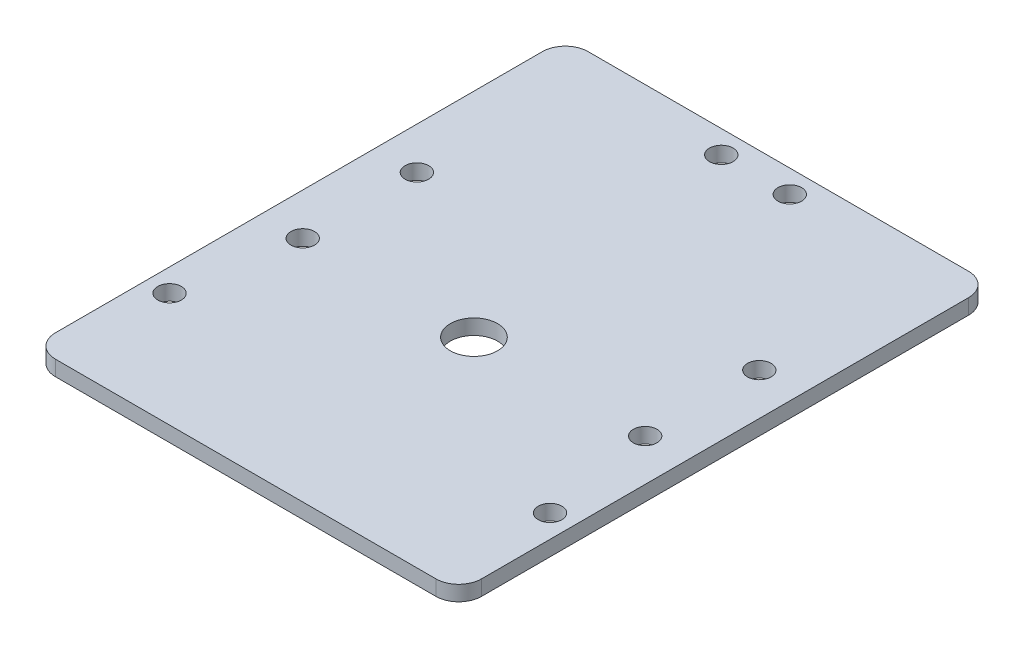
ISO-10303-21;
HEADER;
FILE_DESCRIPTION(('STEP AP214'),'2;1');
FILE_NAME('part.step','',(''),(''),'','','');
FILE_SCHEMA(('AUTOMOTIVE_DESIGN { 1 0 10303 214 1 1 1 1 }'));
ENDSEC;
DATA;
#1=APPLICATION_CONTEXT('core data for automotive mechanical design processes');
#2=APPLICATION_PROTOCOL_DEFINITION('international standard','automotive_design',2000,#1);
#3=PRODUCT_CONTEXT('',#1,'mechanical');
#4=PRODUCT('Part','Part','',(#3));
#5=PRODUCT_RELATED_PRODUCT_CATEGORY('part','',(#4));
#6=PRODUCT_DEFINITION_FORMATION('','',#4);
#7=PRODUCT_DEFINITION_CONTEXT('part definition',#1,'design');
#8=PRODUCT_DEFINITION('design','',#6,#7);
#9=PRODUCT_DEFINITION_SHAPE('','',#8);
#10=(LENGTH_UNIT() NAMED_UNIT(*) SI_UNIT(.MILLI.,.METRE.));
#11=(NAMED_UNIT(*) PLANE_ANGLE_UNIT() SI_UNIT($,.RADIAN.));
#12=(NAMED_UNIT(*) SI_UNIT($,.STERADIAN.) SOLID_ANGLE_UNIT());
#13=UNCERTAINTY_MEASURE_WITH_UNIT(LENGTH_MEASURE(1.E-05),#10,'distance_accuracy_value','');
#14=(GEOMETRIC_REPRESENTATION_CONTEXT(3) GLOBAL_UNCERTAINTY_ASSIGNED_CONTEXT((#13)) GLOBAL_UNIT_ASSIGNED_CONTEXT((#10,
#11,#12)) REPRESENTATION_CONTEXT('',''));
#15=CARTESIAN_POINT('',(0.,0.,0.));
#16=DIRECTION('',(0.,0.,1.));
#17=DIRECTION('',(1.,0.,0.));
#18=AXIS2_PLACEMENT_3D('',#15,#16,#17);
#19=CARTESIAN_POINT('',(28.,2.,0.));
#20=DIRECTION('',(1.,0.,0.));
#21=DIRECTION('',(0.,0.,-1.));
#22=AXIS2_PLACEMENT_3D('',#19,#20,#21);
#23=PLANE('',#22);
#24=DIRECTION('',(0.,0.,1.));
#25=VECTOR('',#24,1.);
#26=CARTESIAN_POINT('',(28.,2.,0.));
#27=LINE('',#26,#25);
#28=CARTESIAN_POINT('',(28.,2.,-32.));
#29=VERTEX_POINT('',#28);
#30=CARTESIAN_POINT('',(28.,2.,32.));
#31=VERTEX_POINT('',#30);
#32=EDGE_CURVE('E184',#29,#31,#27,.T.);
#33=ORIENTED_EDGE('',*,*,#32,.T.);
#34=DIRECTION('',(0.,-1.,0.));
#35=VECTOR('',#34,1.);
#36=CARTESIAN_POINT('',(28.,0.,32.));
#37=LINE('',#36,#35);
#38=CARTESIAN_POINT('',(28.,0.,32.));
#39=VERTEX_POINT('',#38);
#40=EDGE_CURVE('E128',#31,#39,#37,.T.);
#41=ORIENTED_EDGE('',*,*,#40,.T.);
#42=DIRECTION('',(0.,0.,1.));
#43=VECTOR('',#42,1.);
#44=CARTESIAN_POINT('',(28.,0.,0.));
#45=LINE('',#44,#43);
#46=CARTESIAN_POINT('',(28.,0.,-32.));
#47=VERTEX_POINT('',#46);
#48=EDGE_CURVE('E111',#47,#39,#45,.T.);
#49=ORIENTED_EDGE('',*,*,#48,.F.);
#50=DIRECTION('',(0.,-1.,0.));
#51=VECTOR('',#50,1.);
#52=CARTESIAN_POINT('',(28.,2.,-32.));
#53=LINE('',#52,#51);
#54=EDGE_CURVE('E125',#47,#29,#53,.F.);
#55=ORIENTED_EDGE('',*,*,#54,.T.);
#56=EDGE_LOOP('',(#33,#41,#49,#55));
#57=FACE_BOUND('',#56,.T.);
#58=ADVANCED_FACE('F41',(#57),#23,.T.);
#59=CARTESIAN_POINT('',(0.,2.,-35.));
#60=DIRECTION('',(0.,0.,-1.));
#61=DIRECTION('',(-1.,0.,0.));
#62=AXIS2_PLACEMENT_3D('',#59,#60,#61);
#63=PLANE('',#62);
#64=DIRECTION('',(1.,0.,0.));
#65=VECTOR('',#64,1.);
#66=CARTESIAN_POINT('',(0.,2.,-35.));
#67=LINE('',#66,#65);
#68=CARTESIAN_POINT('',(-25.,2.,-35.));
#69=VERTEX_POINT('',#68);
#70=CARTESIAN_POINT('',(25.,2.,-35.));
#71=VERTEX_POINT('',#70);
#72=EDGE_CURVE('E182',#69,#71,#67,.T.);
#73=ORIENTED_EDGE('',*,*,#72,.T.);
#74=DIRECTION('',(0.,-1.,0.));
#75=VECTOR('',#74,1.);
#76=CARTESIAN_POINT('',(25.,2.,-35.));
#77=LINE('',#76,#75);
#78=CARTESIAN_POINT('',(25.,0.,-35.));
#79=VERTEX_POINT('',#78);
#80=EDGE_CURVE('E175',#71,#79,#77,.T.);
#81=ORIENTED_EDGE('',*,*,#80,.T.);
#82=DIRECTION('',(1.,0.,0.));
#83=VECTOR('',#82,1.);
#84=CARTESIAN_POINT('',(0.,0.,-35.));
#85=LINE('',#84,#83);
#86=CARTESIAN_POINT('',(-25.,0.,-35.));
#87=VERTEX_POINT('',#86);
#88=EDGE_CURVE('E113',#87,#79,#85,.T.);
#89=ORIENTED_EDGE('',*,*,#88,.F.);
#90=DIRECTION('',(0.,-1.,0.));
#91=VECTOR('',#90,1.);
#92=CARTESIAN_POINT('',(-25.,2.,-35.));
#93=LINE('',#92,#91);
#94=EDGE_CURVE('E172',#87,#69,#93,.F.);
#95=ORIENTED_EDGE('',*,*,#94,.T.);
#96=EDGE_LOOP('',(#73,#81,#89,#95));
#97=FACE_BOUND('',#96,.T.);
#98=ADVANCED_FACE('F180',(#97),#63,.T.);
#99=CARTESIAN_POINT('',(-28.,2.,0.));
#100=DIRECTION('',(1.,0.,0.));
#101=DIRECTION('',(0.,0.,-1.));
#102=AXIS2_PLACEMENT_3D('',#99,#100,#101);
#103=PLANE('',#102);
#104=DIRECTION('',(0.,0.,1.));
#105=VECTOR('',#104,1.);
#106=CARTESIAN_POINT('',(-28.,2.,0.));
#107=LINE('',#106,#105);
#108=CARTESIAN_POINT('',(-28.,2.,-32.));
#109=VERTEX_POINT('',#108);
#110=CARTESIAN_POINT('',(-28.,2.,32.));
#111=VERTEX_POINT('',#110);
#112=EDGE_CURVE('E143',#109,#111,#107,.T.);
#113=ORIENTED_EDGE('',*,*,#112,.F.);
#114=DIRECTION('',(0.,-1.,0.));
#115=VECTOR('',#114,1.);
#116=CARTESIAN_POINT('',(-28.,0.,-32.));
#117=LINE('',#116,#115);
#118=CARTESIAN_POINT('',(-28.,0.,-32.));
#119=VERTEX_POINT('',#118);
#120=EDGE_CURVE('E11',#109,#119,#117,.T.);
#121=ORIENTED_EDGE('',*,*,#120,.T.);
#122=DIRECTION('',(0.,0.,1.));
#123=VECTOR('',#122,1.);
#124=CARTESIAN_POINT('',(-28.,0.,0.));
#125=LINE('',#124,#123);
#126=CARTESIAN_POINT('',(-28.,0.,32.));
#127=VERTEX_POINT('',#126);
#128=EDGE_CURVE('E229',#119,#127,#125,.T.);
#129=ORIENTED_EDGE('',*,*,#128,.T.);
#130=DIRECTION('',(0.,-1.,0.));
#131=VECTOR('',#130,1.);
#132=CARTESIAN_POINT('',(-28.,2.,32.));
#133=LINE('',#132,#131);
#134=EDGE_CURVE('E50',#127,#111,#133,.F.);
#135=ORIENTED_EDGE('',*,*,#134,.T.);
#136=EDGE_LOOP('',(#113,#121,#129,#135));
#137=FACE_BOUND('',#136,.T.);
#138=ADVANCED_FACE('F305',(#137),#103,.F.);
#139=CARTESIAN_POINT('',(-22.5,2.,5.));
#140=DIRECTION('',(0.,-1.,0.));
#141=DIRECTION('',(0.,0.,-1.));
#142=AXIS2_PLACEMENT_3D('',#139,#140,#141);
#143=CYLINDRICAL_SURFACE('',#142,1.55);
#144=CARTESIAN_POINT('',(-22.5,2.,5.));
#145=DIRECTION('',(0.,1.,0.));
#146=DIRECTION('',(0.,0.,1.));
#147=AXIS2_PLACEMENT_3D('',#144,#145,#146);
#148=CIRCLE('',#147,1.55);
#149=CARTESIAN_POINT('',(-22.5,2.,6.55));
#150=VERTEX_POINT('',#149);
#151=EDGE_CURVE('E189',#150,#150,#148,.T.);
#152=ORIENTED_EDGE('',*,*,#151,.T.);
#153=EDGE_LOOP('',(#152));
#154=FACE_BOUND('',#153,.T.);
#155=CARTESIAN_POINT('',(-22.5,0.,5.));
#156=DIRECTION('',(0.,1.,0.));
#157=DIRECTION('',(0.,0.,1.));
#158=AXIS2_PLACEMENT_3D('',#155,#156,#157);
#159=CIRCLE('',#158,1.55);
#160=CARTESIAN_POINT('',(-22.5,0.,6.55));
#161=VERTEX_POINT('',#160);
#162=EDGE_CURVE('E130',#161,#161,#159,.T.);
#163=ORIENTED_EDGE('',*,*,#162,.F.);
#164=EDGE_LOOP('',(#163));
#165=FACE_BOUND('',#164,.T.);
#166=ADVANCED_FACE('F275',(#154,#165),#143,.F.);
#167=CARTESIAN_POINT('',(22.5,2.,5.));
#168=DIRECTION('',(0.,-1.,0.));
#169=DIRECTION('',(0.,0.,-1.));
#170=AXIS2_PLACEMENT_3D('',#167,#168,#169);
#171=CYLINDRICAL_SURFACE('',#170,1.55);
#172=CARTESIAN_POINT('',(22.5,2.,5.));
#173=DIRECTION('',(0.,1.,0.));
#174=DIRECTION('',(0.,0.,1.));
#175=AXIS2_PLACEMENT_3D('',#172,#173,#174);
#176=CIRCLE('',#175,1.55);
#177=CARTESIAN_POINT('',(22.5,2.,6.55));
#178=VERTEX_POINT('',#177);
#179=EDGE_CURVE('E268',#178,#178,#176,.T.);
#180=ORIENTED_EDGE('',*,*,#179,.T.);
#181=EDGE_LOOP('',(#180));
#182=FACE_BOUND('',#181,.T.);
#183=CARTESIAN_POINT('',(22.5,0.,5.));
#184=DIRECTION('',(0.,1.,0.));
#185=DIRECTION('',(0.,0.,1.));
#186=AXIS2_PLACEMENT_3D('',#183,#184,#185);
#187=CIRCLE('',#186,1.55);
#188=CARTESIAN_POINT('',(22.5,0.,6.55));
#189=VERTEX_POINT('',#188);
#190=EDGE_CURVE('E221',#189,#189,#187,.T.);
#191=ORIENTED_EDGE('',*,*,#190,.F.);
#192=EDGE_LOOP('',(#191));
#193=FACE_BOUND('',#192,.T.);
#194=ADVANCED_FACE('F310',(#182,#193),#171,.F.);
#195=CARTESIAN_POINT('',(-4.5,2.,-32.));
#196=DIRECTION('',(0.,-1.,0.));
#197=DIRECTION('',(0.,0.,-1.));
#198=AXIS2_PLACEMENT_3D('',#195,#196,#197);
#199=CYLINDRICAL_SURFACE('',#198,1.55);
#200=CARTESIAN_POINT('',(-4.5,2.,-32.));
#201=DIRECTION('',(0.,1.,0.));
#202=DIRECTION('',(0.,0.,1.));
#203=AXIS2_PLACEMENT_3D('',#200,#201,#202);
#204=CIRCLE('',#203,1.55);
#205=CARTESIAN_POINT('',(-4.5,2.,-30.45));
#206=VERTEX_POINT('',#205);
#207=EDGE_CURVE('E264',#206,#206,#204,.T.);
#208=ORIENTED_EDGE('',*,*,#207,.T.);
#209=EDGE_LOOP('',(#208));
#210=FACE_BOUND('',#209,.T.);
#211=CARTESIAN_POINT('',(-4.5,0.,-32.));
#212=DIRECTION('',(0.,1.,0.));
#213=DIRECTION('',(0.,0.,1.));
#214=AXIS2_PLACEMENT_3D('',#211,#212,#213);
#215=CIRCLE('',#214,1.55);
#216=CARTESIAN_POINT('',(-4.5,0.,-30.45));
#217=VERTEX_POINT('',#216);
#218=EDGE_CURVE('E217',#217,#217,#215,.T.);
#219=ORIENTED_EDGE('',*,*,#218,.F.);
#220=EDGE_LOOP('',(#219));
#221=FACE_BOUND('',#220,.T.);
#222=ADVANCED_FACE('F313',(#210,#221),#199,.F.);
#223=CARTESIAN_POINT('',(-22.5,2.,-10.));
#224=DIRECTION('',(0.,-1.,0.));
#225=DIRECTION('',(0.,0.,-1.));
#226=AXIS2_PLACEMENT_3D('',#223,#224,#225);
#227=CYLINDRICAL_SURFACE('',#226,1.55);
#228=CARTESIAN_POINT('',(-22.5,2.,-10.));
#229=DIRECTION('',(0.,1.,0.));
#230=DIRECTION('',(0.,0.,1.));
#231=AXIS2_PLACEMENT_3D('',#228,#229,#230);
#232=CIRCLE('',#231,1.55);
#233=CARTESIAN_POINT('',(-22.5,2.,-8.45));
#234=VERTEX_POINT('',#233);
#235=EDGE_CURVE('E260',#234,#234,#232,.T.);
#236=ORIENTED_EDGE('',*,*,#235,.T.);
#237=EDGE_LOOP('',(#236));
#238=FACE_BOUND('',#237,.T.);
#239=CARTESIAN_POINT('',(-22.5,0.,-10.));
#240=DIRECTION('',(0.,1.,0.));
#241=DIRECTION('',(0.,0.,1.));
#242=AXIS2_PLACEMENT_3D('',#239,#240,#241);
#243=CIRCLE('',#242,1.55);
#244=CARTESIAN_POINT('',(-22.5,0.,-8.45));
#245=VERTEX_POINT('',#244);
#246=EDGE_CURVE('E213',#245,#245,#243,.T.);
#247=ORIENTED_EDGE('',*,*,#246,.F.);
#248=EDGE_LOOP('',(#247));
#249=FACE_BOUND('',#248,.T.);
#250=ADVANCED_FACE('F317',(#238,#249),#227,.F.);
#251=CARTESIAN_POINT('',(22.5,2.,-10.));
#252=DIRECTION('',(0.,-1.,0.));
#253=DIRECTION('',(0.,0.,-1.));
#254=AXIS2_PLACEMENT_3D('',#251,#252,#253);
#255=CYLINDRICAL_SURFACE('',#254,1.55);
#256=CARTESIAN_POINT('',(22.5,2.,-10.));
#257=DIRECTION('',(0.,1.,0.));
#258=DIRECTION('',(0.,0.,1.));
#259=AXIS2_PLACEMENT_3D('',#256,#257,#258);
#260=CIRCLE('',#259,1.55);
#261=CARTESIAN_POINT('',(22.5,2.,-8.45));
#262=VERTEX_POINT('',#261);
#263=EDGE_CURVE('E256',#262,#262,#260,.T.);
#264=ORIENTED_EDGE('',*,*,#263,.T.);
#265=EDGE_LOOP('',(#264));
#266=FACE_BOUND('',#265,.T.);
#267=CARTESIAN_POINT('',(22.5,0.,-10.));
#268=DIRECTION('',(0.,1.,0.));
#269=DIRECTION('',(0.,0.,1.));
#270=AXIS2_PLACEMENT_3D('',#267,#268,#269);
#271=CIRCLE('',#270,1.55);
#272=CARTESIAN_POINT('',(22.5,0.,-8.45));
#273=VERTEX_POINT('',#272);
#274=EDGE_CURVE('E209',#273,#273,#271,.T.);
#275=ORIENTED_EDGE('',*,*,#274,.F.);
#276=EDGE_LOOP('',(#275));
#277=FACE_BOUND('',#276,.T.);
#278=ADVANCED_FACE('F321',(#266,#277),#255,.F.);
#279=CARTESIAN_POINT('',(-25.,2.,20.));
#280=DIRECTION('',(0.,-1.,0.));
#281=DIRECTION('',(0.,0.,-1.));
#282=AXIS2_PLACEMENT_3D('',#279,#280,#281);
#283=CYLINDRICAL_SURFACE('',#282,1.55);
#284=CARTESIAN_POINT('',(-25.,2.,20.));
#285=DIRECTION('',(0.,1.,0.));
#286=DIRECTION('',(0.,0.,1.));
#287=AXIS2_PLACEMENT_3D('',#284,#285,#286);
#288=CIRCLE('',#287,1.55);
#289=CARTESIAN_POINT('',(-25.,2.,21.55));
#290=VERTEX_POINT('',#289);
#291=EDGE_CURVE('E252',#290,#290,#288,.T.);
#292=ORIENTED_EDGE('',*,*,#291,.T.);
#293=EDGE_LOOP('',(#292));
#294=FACE_BOUND('',#293,.T.);
#295=CARTESIAN_POINT('',(-25.,0.,20.));
#296=DIRECTION('',(0.,1.,0.));
#297=DIRECTION('',(0.,0.,1.));
#298=AXIS2_PLACEMENT_3D('',#295,#296,#297);
#299=CIRCLE('',#298,1.55);
#300=CARTESIAN_POINT('',(-25.,0.,21.55));
#301=VERTEX_POINT('',#300);
#302=EDGE_CURVE('E205',#301,#301,#299,.T.);
#303=ORIENTED_EDGE('',*,*,#302,.F.);
#304=EDGE_LOOP('',(#303));
#305=FACE_BOUND('',#304,.T.);
#306=ADVANCED_FACE('F325',(#294,#305),#283,.F.);
#307=CARTESIAN_POINT('',(25.,2.,20.));
#308=DIRECTION('',(0.,-1.,0.));
#309=DIRECTION('',(0.,0.,-1.));
#310=AXIS2_PLACEMENT_3D('',#307,#308,#309);
#311=CYLINDRICAL_SURFACE('',#310,1.55);
#312=CARTESIAN_POINT('',(25.,2.,20.));
#313=DIRECTION('',(0.,1.,0.));
#314=DIRECTION('',(0.,0.,1.));
#315=AXIS2_PLACEMENT_3D('',#312,#313,#314);
#316=CIRCLE('',#315,1.55);
#317=CARTESIAN_POINT('',(25.,2.,21.55));
#318=VERTEX_POINT('',#317);
#319=EDGE_CURVE('E246',#318,#318,#316,.T.);
#320=ORIENTED_EDGE('',*,*,#319,.T.);
#321=EDGE_LOOP('',(#320));
#322=FACE_BOUND('',#321,.T.);
#323=CARTESIAN_POINT('',(25.,0.,20.));
#324=DIRECTION('',(0.,1.,0.));
#325=DIRECTION('',(0.,0.,1.));
#326=AXIS2_PLACEMENT_3D('',#323,#324,#325);
#327=CIRCLE('',#326,1.55);
#328=CARTESIAN_POINT('',(25.,0.,21.55));
#329=VERTEX_POINT('',#328);
#330=EDGE_CURVE('E201',#329,#329,#327,.T.);
#331=ORIENTED_EDGE('',*,*,#330,.F.);
#332=EDGE_LOOP('',(#331));
#333=FACE_BOUND('',#332,.T.);
#334=ADVANCED_FACE('F329',(#322,#333),#311,.F.);
#335=CARTESIAN_POINT('',(0.,2.,5.));
#336=DIRECTION('',(0.,-1.,0.));
#337=DIRECTION('',(0.,0.,-1.));
#338=AXIS2_PLACEMENT_3D('',#335,#336,#337);
#339=CYLINDRICAL_SURFACE('',#338,3.1);
#340=CARTESIAN_POINT('',(0.,2.,5.));
#341=DIRECTION('',(0.,1.,0.));
#342=DIRECTION('',(0.,0.,1.));
#343=AXIS2_PLACEMENT_3D('',#340,#341,#342);
#344=CIRCLE('',#343,3.1);
#345=CARTESIAN_POINT('',(0.,2.,8.1));
#346=VERTEX_POINT('',#345);
#347=EDGE_CURVE('E240',#346,#346,#344,.T.);
#348=ORIENTED_EDGE('',*,*,#347,.T.);
#349=EDGE_LOOP('',(#348));
#350=FACE_BOUND('',#349,.T.);
#351=CARTESIAN_POINT('',(0.,0.,5.));
#352=DIRECTION('',(0.,1.,0.));
#353=DIRECTION('',(0.,0.,1.));
#354=AXIS2_PLACEMENT_3D('',#351,#352,#353);
#355=CIRCLE('',#354,3.1);
#356=CARTESIAN_POINT('',(0.,0.,8.1));
#357=VERTEX_POINT('',#356);
#358=EDGE_CURVE('E197',#357,#357,#355,.T.);
#359=ORIENTED_EDGE('',*,*,#358,.F.);
#360=EDGE_LOOP('',(#359));
#361=FACE_BOUND('',#360,.T.);
#362=ADVANCED_FACE('F296',(#350,#361),#339,.F.);
#363=CARTESIAN_POINT('',(4.5,2.,-32.));
#364=DIRECTION('',(0.,-1.,0.));
#365=DIRECTION('',(0.,0.,-1.));
#366=AXIS2_PLACEMENT_3D('',#363,#364,#365);
#367=CYLINDRICAL_SURFACE('',#366,1.55);
#368=CARTESIAN_POINT('',(4.5,2.,-32.));
#369=DIRECTION('',(0.,1.,0.));
#370=DIRECTION('',(0.,0.,1.));
#371=AXIS2_PLACEMENT_3D('',#368,#369,#370);
#372=CIRCLE('',#371,1.55);
#373=CARTESIAN_POINT('',(4.5,2.,-30.45));
#374=VERTEX_POINT('',#373);
#375=EDGE_CURVE('E234',#374,#374,#372,.T.);
#376=ORIENTED_EDGE('',*,*,#375,.T.);
#377=EDGE_LOOP('',(#376));
#378=FACE_BOUND('',#377,.T.);
#379=CARTESIAN_POINT('',(4.5,0.,-32.));
#380=DIRECTION('',(0.,1.,0.));
#381=DIRECTION('',(0.,0.,1.));
#382=AXIS2_PLACEMENT_3D('',#379,#380,#381);
#383=CIRCLE('',#382,1.55);
#384=CARTESIAN_POINT('',(4.5,0.,-30.45));
#385=VERTEX_POINT('',#384);
#386=EDGE_CURVE('E193',#385,#385,#383,.T.);
#387=ORIENTED_EDGE('',*,*,#386,.F.);
#388=EDGE_LOOP('',(#387));
#389=FACE_BOUND('',#388,.T.);
#390=ADVANCED_FACE('F291',(#378,#389),#367,.F.);
#391=CARTESIAN_POINT('',(0.,2.,35.));
#392=DIRECTION('',(0.,0.,-1.));
#393=DIRECTION('',(-1.,0.,0.));
#394=AXIS2_PLACEMENT_3D('',#391,#392,#393);
#395=PLANE('',#394);
#396=DIRECTION('',(1.,0.,0.));
#397=VECTOR('',#396,1.);
#398=CARTESIAN_POINT('',(0.,0.,35.));
#399=LINE('',#398,#397);
#400=CARTESIAN_POINT('',(-25.,0.,35.));
#401=VERTEX_POINT('',#400);
#402=CARTESIAN_POINT('',(25.,0.,35.));
#403=VERTEX_POINT('',#402);
#404=EDGE_CURVE('E146',#401,#403,#399,.T.);
#405=ORIENTED_EDGE('',*,*,#404,.T.);
#406=DIRECTION('',(0.,-1.,0.));
#407=VECTOR('',#406,1.);
#408=CARTESIAN_POINT('',(25.,2.,35.));
#409=LINE('',#408,#407);
#410=CARTESIAN_POINT('',(25.,2.,35.));
#411=VERTEX_POINT('',#410);
#412=EDGE_CURVE('E159',#403,#411,#409,.F.);
#413=ORIENTED_EDGE('',*,*,#412,.T.);
#414=DIRECTION('',(1.,0.,0.));
#415=VECTOR('',#414,1.);
#416=CARTESIAN_POINT('',(0.,2.,35.));
#417=LINE('',#416,#415);
#418=CARTESIAN_POINT('',(-25.,2.,35.));
#419=VERTEX_POINT('',#418);
#420=EDGE_CURVE('E136',#419,#411,#417,.T.);
#421=ORIENTED_EDGE('',*,*,#420,.F.);
#422=DIRECTION('',(0.,-1.,0.));
#423=VECTOR('',#422,1.);
#424=CARTESIAN_POINT('',(-25.,2.,35.));
#425=LINE('',#424,#423);
#426=EDGE_CURVE('E155',#419,#401,#425,.T.);
#427=ORIENTED_EDGE('',*,*,#426,.T.);
#428=EDGE_LOOP('',(#405,#413,#421,#427));
#429=FACE_BOUND('',#428,.T.);
#430=ADVANCED_FACE('F280',(#429),#395,.F.);
#431=CARTESIAN_POINT('',(0.,2.,0.));
#432=DIRECTION('',(0.,1.,0.));
#433=DIRECTION('',(0.,0.,1.));
#434=AXIS2_PLACEMENT_3D('',#431,#432,#433);
#435=PLANE('',#434);
#436=ORIENTED_EDGE('',*,*,#375,.F.);
#437=EDGE_LOOP('',(#436));
#438=FACE_BOUND('',#437,.T.);
#439=ORIENTED_EDGE('',*,*,#347,.F.);
#440=EDGE_LOOP('',(#439));
#441=FACE_BOUND('',#440,.T.);
#442=ORIENTED_EDGE('',*,*,#319,.F.);
#443=EDGE_LOOP('',(#442));
#444=FACE_BOUND('',#443,.T.);
#445=ORIENTED_EDGE('',*,*,#291,.F.);
#446=EDGE_LOOP('',(#445));
#447=FACE_BOUND('',#446,.T.);
#448=ORIENTED_EDGE('',*,*,#263,.F.);
#449=EDGE_LOOP('',(#448));
#450=FACE_BOUND('',#449,.T.);
#451=ORIENTED_EDGE('',*,*,#235,.F.);
#452=EDGE_LOOP('',(#451));
#453=FACE_BOUND('',#452,.T.);
#454=ORIENTED_EDGE('',*,*,#207,.F.);
#455=EDGE_LOOP('',(#454));
#456=FACE_BOUND('',#455,.T.);
#457=ORIENTED_EDGE('',*,*,#179,.F.);
#458=EDGE_LOOP('',(#457));
#459=FACE_BOUND('',#458,.T.);
#460=ORIENTED_EDGE('',*,*,#151,.F.);
#461=EDGE_LOOP('',(#460));
#462=FACE_BOUND('',#461,.T.);
#463=ORIENTED_EDGE('',*,*,#420,.T.);
#464=CARTESIAN_POINT('',(25.,2.,32.));
#465=DIRECTION('',(0.,1.,0.));
#466=DIRECTION('',(0.,0.,1.));
#467=AXIS2_PLACEMENT_3D('',#464,#465,#466);
#468=CIRCLE('',#467,3.);
#469=EDGE_CURVE('E169',#411,#31,#468,.T.);
#470=ORIENTED_EDGE('',*,*,#469,.T.);
#471=ORIENTED_EDGE('',*,*,#32,.F.);
#472=CARTESIAN_POINT('',(25.,2.,-32.));
#473=DIRECTION('',(0.,1.,0.));
#474=DIRECTION('',(0.,0.,1.));
#475=AXIS2_PLACEMENT_3D('',#472,#473,#474);
#476=CIRCLE('',#475,3.);
#477=EDGE_CURVE('E134',#29,#71,#476,.T.);
#478=ORIENTED_EDGE('',*,*,#477,.T.);
#479=ORIENTED_EDGE('',*,*,#72,.F.);
#480=CARTESIAN_POINT('',(-25.,2.,-32.));
#481=DIRECTION('',(0.,1.,0.));
#482=DIRECTION('',(0.,0.,1.));
#483=AXIS2_PLACEMENT_3D('',#480,#481,#482);
#484=CIRCLE('',#483,3.);
#485=EDGE_CURVE('E63',#69,#109,#484,.T.);
#486=ORIENTED_EDGE('',*,*,#485,.T.);
#487=ORIENTED_EDGE('',*,*,#112,.T.);
#488=CARTESIAN_POINT('',(-25.,2.,32.));
#489=DIRECTION('',(0.,1.,0.));
#490=DIRECTION('',(0.,0.,1.));
#491=AXIS2_PLACEMENT_3D('',#488,#489,#490);
#492=CIRCLE('',#491,3.);
#493=EDGE_CURVE('E162',#111,#419,#492,.T.);
#494=ORIENTED_EDGE('',*,*,#493,.T.);
#495=EDGE_LOOP('',(#463,#470,#471,#478,#479,#486,#487,#494));
#496=FACE_BOUND('',#495,.T.);
#497=ADVANCED_FACE('F278',(#438,#441,#444,#447,#450,#453,#456,#459,#462,#496),#435,.T.);
#498=CARTESIAN_POINT('',(0.,0.,0.));
#499=DIRECTION('',(0.,1.,0.));
#500=DIRECTION('',(0.,0.,1.));
#501=AXIS2_PLACEMENT_3D('',#498,#499,#500);
#502=PLANE('',#501);
#503=ORIENTED_EDGE('',*,*,#386,.T.);
#504=EDGE_LOOP('',(#503));
#505=FACE_BOUND('',#504,.T.);
#506=ORIENTED_EDGE('',*,*,#358,.T.);
#507=EDGE_LOOP('',(#506));
#508=FACE_BOUND('',#507,.T.);
#509=ORIENTED_EDGE('',*,*,#330,.T.);
#510=EDGE_LOOP('',(#509));
#511=FACE_BOUND('',#510,.T.);
#512=ORIENTED_EDGE('',*,*,#302,.T.);
#513=EDGE_LOOP('',(#512));
#514=FACE_BOUND('',#513,.T.);
#515=ORIENTED_EDGE('',*,*,#274,.T.);
#516=EDGE_LOOP('',(#515));
#517=FACE_BOUND('',#516,.T.);
#518=ORIENTED_EDGE('',*,*,#246,.T.);
#519=EDGE_LOOP('',(#518));
#520=FACE_BOUND('',#519,.T.);
#521=ORIENTED_EDGE('',*,*,#218,.T.);
#522=EDGE_LOOP('',(#521));
#523=FACE_BOUND('',#522,.T.);
#524=ORIENTED_EDGE('',*,*,#190,.T.);
#525=EDGE_LOOP('',(#524));
#526=FACE_BOUND('',#525,.T.);
#527=ORIENTED_EDGE('',*,*,#162,.T.);
#528=EDGE_LOOP('',(#527));
#529=FACE_BOUND('',#528,.T.);
#530=ORIENTED_EDGE('',*,*,#48,.T.);
#531=CARTESIAN_POINT('',(25.,0.,32.));
#532=DIRECTION('',(0.,1.,0.));
#533=DIRECTION('',(0.,0.,1.));
#534=AXIS2_PLACEMENT_3D('',#531,#532,#533);
#535=CIRCLE('',#534,3.);
#536=EDGE_CURVE('E119',#39,#403,#535,.F.);
#537=ORIENTED_EDGE('',*,*,#536,.T.);
#538=ORIENTED_EDGE('',*,*,#404,.F.);
#539=CARTESIAN_POINT('',(-25.,0.,32.));
#540=DIRECTION('',(0.,1.,0.));
#541=DIRECTION('',(0.,0.,1.));
#542=AXIS2_PLACEMENT_3D('',#539,#540,#541);
#543=CIRCLE('',#542,3.);
#544=EDGE_CURVE('E140',#401,#127,#543,.F.);
#545=ORIENTED_EDGE('',*,*,#544,.T.);
#546=ORIENTED_EDGE('',*,*,#128,.F.);
#547=CARTESIAN_POINT('',(-25.,0.,-32.));
#548=DIRECTION('',(0.,1.,0.));
#549=DIRECTION('',(0.,0.,1.));
#550=AXIS2_PLACEMENT_3D('',#547,#548,#549);
#551=CIRCLE('',#550,3.);
#552=EDGE_CURVE('E120',#119,#87,#551,.F.);
#553=ORIENTED_EDGE('',*,*,#552,.T.);
#554=ORIENTED_EDGE('',*,*,#88,.T.);
#555=CARTESIAN_POINT('',(25.,0.,-32.));
#556=DIRECTION('',(0.,1.,0.));
#557=DIRECTION('',(0.,0.,1.));
#558=AXIS2_PLACEMENT_3D('',#555,#556,#557);
#559=CIRCLE('',#558,3.);
#560=EDGE_CURVE('E108',#79,#47,#559,.F.);
#561=ORIENTED_EDGE('',*,*,#560,.T.);
#562=EDGE_LOOP('',(#530,#537,#538,#545,#546,#553,#554,#561));
#563=FACE_BOUND('',#562,.T.);
#564=ADVANCED_FACE('F110',(#505,#508,#511,#514,#517,#520,#523,#526,#529,#563),#502,.F.);
#565=CARTESIAN_POINT('',(25.,2.,32.));
#566=DIRECTION('',(0.,1.,0.));
#567=DIRECTION('',(0.,0.,1.));
#568=AXIS2_PLACEMENT_3D('',#565,#566,#567);
#569=CYLINDRICAL_SURFACE('',#568,3.);
#570=ORIENTED_EDGE('',*,*,#469,.F.);
#571=ORIENTED_EDGE('',*,*,#412,.F.);
#572=ORIENTED_EDGE('',*,*,#536,.F.);
#573=ORIENTED_EDGE('',*,*,#40,.F.);
#574=EDGE_LOOP('',(#570,#571,#572,#573));
#575=FACE_BOUND('',#574,.T.);
#576=ADVANCED_FACE('F288',(#575),#569,.T.);
#577=CARTESIAN_POINT('',(25.,2.,-32.));
#578=DIRECTION('',(0.,-1.,0.));
#579=DIRECTION('',(0.,0.,-1.));
#580=AXIS2_PLACEMENT_3D('',#577,#578,#579);
#581=CYLINDRICAL_SURFACE('',#580,3.);
#582=ORIENTED_EDGE('',*,*,#477,.F.);
#583=ORIENTED_EDGE('',*,*,#54,.F.);
#584=ORIENTED_EDGE('',*,*,#560,.F.);
#585=ORIENTED_EDGE('',*,*,#80,.F.);
#586=EDGE_LOOP('',(#582,#583,#584,#585));
#587=FACE_BOUND('',#586,.T.);
#588=ADVANCED_FACE('F133',(#587),#581,.T.);
#589=CARTESIAN_POINT('',(-25.,2.,-32.));
#590=DIRECTION('',(0.,1.,0.));
#591=DIRECTION('',(0.,0.,1.));
#592=AXIS2_PLACEMENT_3D('',#589,#590,#591);
#593=CYLINDRICAL_SURFACE('',#592,3.);
#594=ORIENTED_EDGE('',*,*,#485,.F.);
#595=ORIENTED_EDGE('',*,*,#94,.F.);
#596=ORIENTED_EDGE('',*,*,#552,.F.);
#597=ORIENTED_EDGE('',*,*,#120,.F.);
#598=EDGE_LOOP('',(#594,#595,#596,#597));
#599=FACE_BOUND('',#598,.T.);
#600=ADVANCED_FACE('F340',(#599),#593,.T.);
#601=CARTESIAN_POINT('',(-25.,2.,32.));
#602=DIRECTION('',(0.,-1.,0.));
#603=DIRECTION('',(0.,0.,-1.));
#604=AXIS2_PLACEMENT_3D('',#601,#602,#603);
#605=CYLINDRICAL_SURFACE('',#604,3.);
#606=ORIENTED_EDGE('',*,*,#493,.F.);
#607=ORIENTED_EDGE('',*,*,#134,.F.);
#608=ORIENTED_EDGE('',*,*,#544,.F.);
#609=ORIENTED_EDGE('',*,*,#426,.F.);
#610=EDGE_LOOP('',(#606,#607,#608,#609));
#611=FACE_BOUND('',#610,.T.);
#612=ADVANCED_FACE('F43',(#611),#605,.T.);
#613=CLOSED_SHELL('',(#58,#98,#138,#166,#194,#222,#250,#278,#306,#334,#362,#390,#430,#497,#564,
#576,#588,#600,#612));
#614=MANIFOLD_SOLID_BREP('B2',#613);
#615=ADVANCED_BREP_SHAPE_REPRESENTATION('',(#18,#614),#14);
#616=SHAPE_DEFINITION_REPRESENTATION(#9,#615);
ENDSEC;
END-ISO-10303-21;
